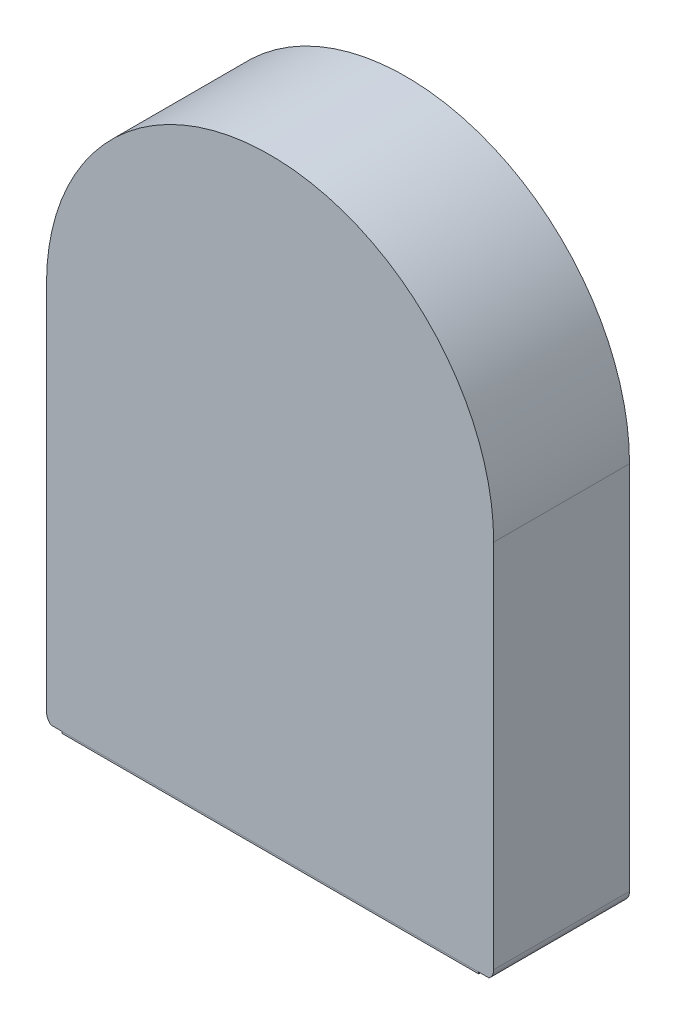
ISO-10303-21;
HEADER;
FILE_DESCRIPTION(('STEP AP214'),'2;1');
FILE_NAME('part.step','',(''),(''),'','','');
FILE_SCHEMA(('AUTOMOTIVE_DESIGN { 1 0 10303 214 1 1 1 1 }'));
ENDSEC;
DATA;
#1=APPLICATION_CONTEXT('core data for automotive mechanical design processes');
#2=APPLICATION_PROTOCOL_DEFINITION('international standard','automotive_design',2000,#1);
#3=PRODUCT_CONTEXT('',#1,'mechanical');
#4=PRODUCT('Part','Part','',(#3));
#5=PRODUCT_RELATED_PRODUCT_CATEGORY('part','',(#4));
#6=PRODUCT_DEFINITION_FORMATION('','',#4);
#7=PRODUCT_DEFINITION_CONTEXT('part definition',#1,'design');
#8=PRODUCT_DEFINITION('design','',#6,#7);
#9=PRODUCT_DEFINITION_SHAPE('','',#8);
#10=(LENGTH_UNIT() NAMED_UNIT(*) SI_UNIT(.MILLI.,.METRE.));
#11=(NAMED_UNIT(*) PLANE_ANGLE_UNIT() SI_UNIT($,.RADIAN.));
#12=(NAMED_UNIT(*) SI_UNIT($,.STERADIAN.) SOLID_ANGLE_UNIT());
#13=UNCERTAINTY_MEASURE_WITH_UNIT(LENGTH_MEASURE(1.E-05),#10,'distance_accuracy_value','');
#14=(GEOMETRIC_REPRESENTATION_CONTEXT(3) GLOBAL_UNCERTAINTY_ASSIGNED_CONTEXT((#13)) GLOBAL_UNIT_ASSIGNED_CONTEXT((#10,
#11,#12)) REPRESENTATION_CONTEXT('',''));
#15=CARTESIAN_POINT('',(0.,0.,0.));
#16=DIRECTION('',(0.,0.,1.));
#17=DIRECTION('',(1.,0.,0.));
#18=AXIS2_PLACEMENT_3D('',#15,#16,#17);
#19=CARTESIAN_POINT('',(8.8,-15.4,5.65));
#20=DIRECTION('',(0.,0.,-1.));
#21=DIRECTION('',(-1.,0.,0.));
#22=AXIS2_PLACEMENT_3D('',#19,#20,#21);
#23=CYLINDRICAL_SURFACE('',#22,0.5);
#24=CARTESIAN_POINT('',(8.8,-15.4,6.03039935251033));
#25=DIRECTION('',(0.,0.713250449154018,-0.700909264300018));
#26=DIRECTION('',(0.,0.700909264300018,0.713250449154018));
#27=AXIS2_PLACEMENT_3D('',#24,#25,#26);
#28=ELLIPSE('',#27,0.713359097199747,0.5);
#29=CARTESIAN_POINT('',(9.10934525730095,-15.7928174026,5.63066545953665));
#30=VERTEX_POINT('',#29);
#31=CARTESIAN_POINT('',(8.8,-15.9,5.52159565602451));
#32=VERTEX_POINT('',#31);
#33=EDGE_CURVE('E55',#30,#32,#28,.T.);
#34=ORIENTED_EDGE('',*,*,#33,.T.);
#35=DIRECTION('',(0.,0.,-1.));
#36=VECTOR('',#35,1.);
#37=CARTESIAN_POINT('',(8.8,-15.9,5.65));
#38=LINE('',#37,#36);
#39=CARTESIAN_POINT('',(8.8,-15.9,0.));
#40=VERTEX_POINT('',#39);
#41=EDGE_CURVE('E257',#40,#32,#38,.F.);
#42=ORIENTED_EDGE('',*,*,#41,.F.);
#43=CARTESIAN_POINT('',(8.8,-15.4,0.));
#44=DIRECTION('',(0.,0.,1.));
#45=DIRECTION('',(1.,0.,0.));
#46=AXIS2_PLACEMENT_3D('',#43,#44,#45);
#47=CIRCLE('',#46,0.5);
#48=CARTESIAN_POINT('',(9.3,-15.4,0.));
#49=VERTEX_POINT('',#48);
#50=EDGE_CURVE('E261',#49,#40,#47,.F.);
#51=ORIENTED_EDGE('',*,*,#50,.F.);
#52=DIRECTION('',(0.,0.,-1.));
#53=VECTOR('',#52,1.);
#54=CARTESIAN_POINT('',(9.3,-15.4,5.65));
#55=LINE('',#54,#53);
#56=CARTESIAN_POINT('',(9.3,-15.4,5.65));
#57=VERTEX_POINT('',#56);
#58=EDGE_CURVE('E265',#57,#49,#55,.T.);
#59=ORIENTED_EDGE('',*,*,#58,.F.);
#60=CARTESIAN_POINT('',(8.8,-15.4,5.65));
#61=DIRECTION('',(0.,0.,1.));
#62=DIRECTION('',(1.,0.,0.));
#63=AXIS2_PLACEMENT_3D('',#60,#61,#62);
#64=CIRCLE('',#63,0.5);
#65=CARTESIAN_POINT('',(9.10934525730095,-15.7928174026,5.65));
#66=VERTEX_POINT('',#65);
#67=EDGE_CURVE('E252',#66,#57,#64,.T.);
#68=ORIENTED_EDGE('',*,*,#67,.F.);
#69=DIRECTION('',(0.,0.,-1.));
#70=VECTOR('',#69,1.);
#71=CARTESIAN_POINT('',(9.10934525730095,-15.7928174026,5.65));
#72=LINE('',#71,#70);
#73=EDGE_CURVE('E48',#30,#66,#72,.F.);
#74=ORIENTED_EDGE('',*,*,#73,.F.);
#75=EDGE_LOOP('',(#34,#42,#51,#59,#68,#74));
#76=FACE_BOUND('',#75,.T.);
#77=ADVANCED_FACE('F38',(#76),#23,.T.);
#78=CARTESIAN_POINT('',(-8.8,-15.4,5.65));
#79=DIRECTION('',(0.,0.,-1.));
#80=DIRECTION('',(-1.,0.,0.));
#81=AXIS2_PLACEMENT_3D('',#78,#79,#80);
#82=CYLINDRICAL_SURFACE('',#81,0.5);
#83=CARTESIAN_POINT('',(-8.8,-15.4,5.65));
#84=DIRECTION('',(0.,0.,1.));
#85=DIRECTION('',(1.,0.,0.));
#86=AXIS2_PLACEMENT_3D('',#83,#84,#85);
#87=CIRCLE('',#86,0.5);
#88=CARTESIAN_POINT('',(-9.3,-15.4,5.65));
#89=VERTEX_POINT('',#88);
#90=CARTESIAN_POINT('',(-9.10934525730095,-15.7928174026,5.65));
#91=VERTEX_POINT('',#90);
#92=EDGE_CURVE('E254',#89,#91,#87,.T.);
#93=ORIENTED_EDGE('',*,*,#92,.F.);
#94=DIRECTION('',(0.,0.,-1.));
#95=VECTOR('',#94,1.);
#96=CARTESIAN_POINT('',(-9.3,-15.4,5.65));
#97=LINE('',#96,#95);
#98=CARTESIAN_POINT('',(-9.3,-15.4,0.));
#99=VERTEX_POINT('',#98);
#100=EDGE_CURVE('E250',#99,#89,#97,.F.);
#101=ORIENTED_EDGE('',*,*,#100,.F.);
#102=CARTESIAN_POINT('',(-8.8,-15.4,0.));
#103=DIRECTION('',(0.,0.,1.));
#104=DIRECTION('',(1.,0.,0.));
#105=AXIS2_PLACEMENT_3D('',#102,#103,#104);
#106=CIRCLE('',#105,0.5);
#107=CARTESIAN_POINT('',(-8.8,-15.9,0.));
#108=VERTEX_POINT('',#107);
#109=EDGE_CURVE('E263',#108,#99,#106,.F.);
#110=ORIENTED_EDGE('',*,*,#109,.F.);
#111=DIRECTION('',(0.,0.,-1.));
#112=VECTOR('',#111,1.);
#113=CARTESIAN_POINT('',(-8.8,-15.9,5.65));
#114=LINE('',#113,#112);
#115=CARTESIAN_POINT('',(-8.8,-15.9,5.52159565602451));
#116=VERTEX_POINT('',#115);
#117=EDGE_CURVE('E259',#116,#108,#114,.T.);
#118=ORIENTED_EDGE('',*,*,#117,.F.);
#119=CARTESIAN_POINT('',(-8.8,-15.4,6.03039935251033));
#120=DIRECTION('',(0.,0.713250449154018,-0.700909264300018));
#121=DIRECTION('',(0.,0.700909264300018,0.713250449154018));
#122=AXIS2_PLACEMENT_3D('',#119,#120,#121);
#123=ELLIPSE('',#122,0.713359097199747,0.5);
#124=CARTESIAN_POINT('',(-9.10934525730095,-15.7928174026,5.63066545953665));
#125=VERTEX_POINT('',#124);
#126=EDGE_CURVE('E145',#116,#125,#123,.T.);
#127=ORIENTED_EDGE('',*,*,#126,.T.);
#128=DIRECTION('',(0.,0.,1.));
#129=VECTOR('',#128,1.);
#130=CARTESIAN_POINT('',(-9.10934525730095,-15.7928174026,5.63066545953665));
#131=LINE('',#130,#129);
#132=EDGE_CURVE('E195',#125,#91,#131,.T.);
#133=ORIENTED_EDGE('',*,*,#132,.T.);
#134=EDGE_LOOP('',(#93,#101,#110,#118,#127,#133));
#135=FACE_BOUND('',#134,.T.);
#136=ADVANCED_FACE('F40',(#135),#82,.T.);
#137=CARTESIAN_POINT('',(0.,0.,5.65));
#138=DIRECTION('',(0.,0.,-1.));
#139=DIRECTION('',(-1.,0.,0.));
#140=AXIS2_PLACEMENT_3D('',#137,#138,#139);
#141=CYLINDRICAL_SURFACE('',#140,9.3);
#142=CARTESIAN_POINT('',(0.,0.,0.));
#143=DIRECTION('',(0.,0.,1.));
#144=DIRECTION('',(1.,0.,0.));
#145=AXIS2_PLACEMENT_3D('',#142,#143,#144);
#146=CIRCLE('',#145,9.3);
#147=CARTESIAN_POINT('',(9.3,0.,0.));
#148=VERTEX_POINT('',#147);
#149=CARTESIAN_POINT('',(-9.3,0.,0.));
#150=VERTEX_POINT('',#149);
#151=EDGE_CURVE('E200',#148,#150,#146,.T.);
#152=ORIENTED_EDGE('',*,*,#151,.T.);
#153=DIRECTION('',(0.,0.,-1.));
#154=VECTOR('',#153,1.);
#155=CARTESIAN_POINT('',(-9.3,0.,5.65));
#156=LINE('',#155,#154);
#157=CARTESIAN_POINT('',(-9.3,0.,5.65));
#158=VERTEX_POINT('',#157);
#159=EDGE_CURVE('E267',#158,#150,#156,.T.);
#160=ORIENTED_EDGE('',*,*,#159,.F.);
#161=CARTESIAN_POINT('',(0.,0.,5.65));
#162=DIRECTION('',(0.,0.,1.));
#163=DIRECTION('',(1.,0.,0.));
#164=AXIS2_PLACEMENT_3D('',#161,#162,#163);
#165=CIRCLE('',#164,9.3);
#166=CARTESIAN_POINT('',(9.3,0.,5.65));
#167=VERTEX_POINT('',#166);
#168=EDGE_CURVE('E244',#167,#158,#165,.T.);
#169=ORIENTED_EDGE('',*,*,#168,.F.);
#170=DIRECTION('',(0.,0.,-1.));
#171=VECTOR('',#170,1.);
#172=CARTESIAN_POINT('',(9.3,0.,5.65));
#173=LINE('',#172,#171);
#174=EDGE_CURVE('E269',#167,#148,#173,.T.);
#175=ORIENTED_EDGE('',*,*,#174,.T.);
#176=EDGE_LOOP('',(#152,#160,#169,#175));
#177=FACE_BOUND('',#176,.T.);
#178=ADVANCED_FACE('F357',(#177),#141,.T.);
#179=CARTESIAN_POINT('',(-9.3,0.,5.65));
#180=DIRECTION('',(1.,0.,0.));
#181=DIRECTION('',(0.,1.,0.));
#182=AXIS2_PLACEMENT_3D('',#179,#180,#181);
#183=PLANE('',#182);
#184=ORIENTED_EDGE('',*,*,#159,.T.);
#185=DIRECTION('',(0.,-1.,0.));
#186=VECTOR('',#185,1.);
#187=CARTESIAN_POINT('',(-9.3,0.,0.));
#188=LINE('',#187,#186);
#189=EDGE_CURVE('E277',#150,#99,#188,.T.);
#190=ORIENTED_EDGE('',*,*,#189,.T.);
#191=ORIENTED_EDGE('',*,*,#100,.T.);
#192=DIRECTION('',(0.,-1.,0.));
#193=VECTOR('',#192,1.);
#194=CARTESIAN_POINT('',(-9.3,0.,5.65));
#195=LINE('',#194,#193);
#196=EDGE_CURVE('E241',#158,#89,#195,.T.);
#197=ORIENTED_EDGE('',*,*,#196,.F.);
#198=EDGE_LOOP('',(#184,#190,#191,#197));
#199=FACE_BOUND('',#198,.T.);
#200=ADVANCED_FACE('F358',(#199),#183,.F.);
#201=CARTESIAN_POINT('',(-9.3,-15.9,5.65));
#202=DIRECTION('',(0.,1.,0.));
#203=DIRECTION('',(0.,0.,1.));
#204=AXIS2_PLACEMENT_3D('',#201,#202,#203);
#205=PLANE('',#204);
#206=ORIENTED_EDGE('',*,*,#41,.T.);
#207=DIRECTION('',(-1.,0.,0.));
#208=VECTOR('',#207,1.);
#209=CARTESIAN_POINT('',(0.,-15.9,5.52159565602451));
#210=LINE('',#209,#208);
#211=EDGE_CURVE('E337',#32,#116,#210,.T.);
#212=ORIENTED_EDGE('',*,*,#211,.T.);
#213=ORIENTED_EDGE('',*,*,#117,.T.);
#214=DIRECTION('',(1.,0.,0.));
#215=VECTOR('',#214,1.);
#216=CARTESIAN_POINT('',(-9.3,-15.9,0.));
#217=LINE('',#216,#215);
#218=EDGE_CURVE('E274',#108,#40,#217,.T.);
#219=ORIENTED_EDGE('',*,*,#218,.T.);
#220=EDGE_LOOP('',(#206,#212,#213,#219));
#221=FACE_BOUND('',#220,.T.);
#222=ADVANCED_FACE('F343',(#221),#205,.F.);
#223=CARTESIAN_POINT('',(9.3,0.,5.65));
#224=DIRECTION('',(-1.,0.,0.));
#225=DIRECTION('',(0.,-1.,0.));
#226=AXIS2_PLACEMENT_3D('',#223,#224,#225);
#227=PLANE('',#226);
#228=ORIENTED_EDGE('',*,*,#58,.T.);
#229=DIRECTION('',(0.,1.,0.));
#230=VECTOR('',#229,1.);
#231=CARTESIAN_POINT('',(9.3,0.,0.));
#232=LINE('',#231,#230);
#233=EDGE_CURVE('E247',#49,#148,#232,.T.);
#234=ORIENTED_EDGE('',*,*,#233,.T.);
#235=ORIENTED_EDGE('',*,*,#174,.F.);
#236=DIRECTION('',(0.,1.,0.));
#237=VECTOR('',#236,1.);
#238=CARTESIAN_POINT('',(9.3,0.,5.65));
#239=LINE('',#238,#237);
#240=EDGE_CURVE('E271',#57,#167,#239,.T.);
#241=ORIENTED_EDGE('',*,*,#240,.F.);
#242=EDGE_LOOP('',(#228,#234,#235,#241));
#243=FACE_BOUND('',#242,.T.);
#244=ADVANCED_FACE('F354',(#243),#227,.F.);
#245=CARTESIAN_POINT('',(0.,0.,5.65));
#246=DIRECTION('',(0.,0.,1.));
#247=DIRECTION('',(1.,0.,0.));
#248=AXIS2_PLACEMENT_3D('',#245,#246,#247);
#249=PLANE('',#248);
#250=DIRECTION('',(1.,0.,0.));
#251=VECTOR('',#250,1.);
#252=CARTESIAN_POINT('',(-5.00000000075,-15.7926514013,5.64999710245));
#253=LINE('',#252,#251);
#254=CARTESIAN_POINT('',(-6.97971042440521,-15.7927344019421,5.64999855122482));
#255=VERTEX_POINT('',#254);
#256=CARTESIAN_POINT('',(2.97381740255382,-15.7926513759911,5.64999855122139));
#257=VERTEX_POINT('',#256);
#258=EDGE_CURVE('E176',#255,#257,#253,.T.);
#259=ORIENTED_EDGE('',*,*,#258,.T.);
#260=DIRECTION('',(0.999999999999744,1.24820653344968E-08,7.15097058320817E-07));
#261=VECTOR('',#260,1.);
#262=CARTESIAN_POINT('',(4.99999999925,-15.792651376,5.64999855136));
#263=LINE('',#262,#261);
#264=CARTESIAN_POINT('',(6.97971041935568,-15.7927343769389,5.64999998352249));
#265=VERTEX_POINT('',#264);
#266=EDGE_CURVE('E179',#257,#265,#263,.T.);
#267=ORIENTED_EDGE('',*,*,#266,.T.);
#268=DIRECTION('',(-1.,0.,0.));
#269=VECTOR('',#268,1.);
#270=CARTESIAN_POINT('',(0.,-15.7928174026,5.65));
#271=LINE('',#270,#269);
#272=EDGE_CURVE('E198',#66,#265,#271,.T.);
#273=ORIENTED_EDGE('',*,*,#272,.F.);
#274=ORIENTED_EDGE('',*,*,#67,.T.);
#275=ORIENTED_EDGE('',*,*,#240,.T.);
#276=ORIENTED_EDGE('',*,*,#168,.T.);
#277=ORIENTED_EDGE('',*,*,#196,.T.);
#278=ORIENTED_EDGE('',*,*,#92,.T.);
#279=DIRECTION('',(-1.,0.,0.));
#280=VECTOR('',#279,1.);
#281=CARTESIAN_POINT('',(0.,-15.7928174026,5.65));
#282=LINE('',#281,#280);
#283=EDGE_CURVE('E11',#255,#91,#282,.T.);
#284=ORIENTED_EDGE('',*,*,#283,.F.);
#285=EDGE_LOOP('',(#259,#267,#273,#274,#275,#276,#277,#278,#284));
#286=FACE_BOUND('',#285,.T.);
#287=ADVANCED_FACE('F287',(#286),#249,.T.);
#288=CARTESIAN_POINT('',(0.,0.,0.));
#289=DIRECTION('',(0.,0.,1.));
#290=DIRECTION('',(1.,0.,0.));
#291=AXIS2_PLACEMENT_3D('',#288,#289,#290);
#292=PLANE('',#291);
#293=ORIENTED_EDGE('',*,*,#233,.F.);
#294=ORIENTED_EDGE('',*,*,#50,.T.);
#295=ORIENTED_EDGE('',*,*,#218,.F.);
#296=ORIENTED_EDGE('',*,*,#109,.T.);
#297=ORIENTED_EDGE('',*,*,#189,.F.);
#298=ORIENTED_EDGE('',*,*,#151,.F.);
#299=EDGE_LOOP('',(#293,#294,#295,#296,#297,#298));
#300=FACE_BOUND('',#299,.T.);
#301=ADVANCED_FACE('F220',(#300),#292,.F.);
#302=CARTESIAN_POINT('',(-10.,-15.7928174026,7.15));
#303=DIRECTION('',(0.,1.,0.));
#304=DIRECTION('',(0.,0.,1.));
#305=AXIS2_PLACEMENT_3D('',#302,#303,#304);
#306=PLANE('',#305);
#307=ORIENTED_EDGE('',*,*,#272,.T.);
#308=CARTESIAN_POINT('',(6.97975192830906,-15.7928174026,5.64048689252252));
#309=DIRECTION('',(-0.00436264473487639,0.0174522403538263,0.999838180225955));
#310=VECTOR('',#309,1.);
#311=LINE('',#308,#310);
#312=CARTESIAN_POINT('',(6.97975192830905,-15.7928174026,5.64048689252252));
#313=VERTEX_POINT('',#312);
#314=EDGE_CURVE('E187',#313,#265,#311,.T.);
#315=ORIENTED_EDGE('',*,*,#314,.F.);
#316=DIRECTION('',(1.,0.,0.));
#317=VECTOR('',#316,1.);
#318=CARTESIAN_POINT('',(-8.66700053469144,-15.7928174026,5.64048689252252));
#319=LINE('',#318,#317);
#320=CARTESIAN_POINT('',(8.66820089689577,-15.7928174026,5.64048689252252));
#321=VERTEX_POINT('',#320);
#322=EDGE_CURVE('E160',#313,#321,#319,.T.);
#323=ORIENTED_EDGE('',*,*,#322,.T.);
#324=DIRECTION('',(0.,0.,-1.));
#325=VECTOR('',#324,1.);
#326=CARTESIAN_POINT('',(8.66820089689577,-15.7928174026,0.999999999999998));
#327=LINE('',#326,#325);
#328=CARTESIAN_POINT('',(8.66821322781513,-15.7928174026,5.63066545953665));
#329=VERTEX_POINT('',#328);
#330=EDGE_CURVE('E152',#321,#329,#327,.T.);
#331=ORIENTED_EDGE('',*,*,#330,.T.);
#332=DIRECTION('',(-1.,0.,0.));
#333=VECTOR('',#332,1.);
#334=CARTESIAN_POINT('',(-4.99999999999999,-15.7928174026002,5.63066545953649));
#335=LINE('',#334,#333);
#336=EDGE_CURVE('E136',#30,#329,#335,.T.);
#337=ORIENTED_EDGE('',*,*,#336,.F.);
#338=ORIENTED_EDGE('',*,*,#73,.T.);
#339=EDGE_LOOP('',(#307,#315,#323,#331,#337,#338));
#340=FACE_BOUND('',#339,.T.);
#341=ADVANCED_FACE('F157',(#340),#306,.F.);
#342=CARTESIAN_POINT('',(8.27396970801,-15.8738174032,0.999999999999998));
#343=DIRECTION('',(0.,-1.,0.));
#344=DIRECTION('',(0.,0.,-1.));
#345=AXIS2_PLACEMENT_3D('',#342,#343,#344);
#346=PLANE('',#345);
#347=DIRECTION('',(1.,0.,0.));
#348=VECTOR('',#347,1.);
#349=CARTESIAN_POINT('',(8.27396970801,-15.8738174032,5.54823926009538));
#350=LINE('',#349,#348);
#351=CARTESIAN_POINT('',(-8.66700053469144,-15.8738174032,5.54823926009538));
#352=VERTEX_POINT('',#351);
#353=CARTESIAN_POINT('',(8.66820089689577,-15.8738174032,5.54823926009538));
#354=VERTEX_POINT('',#353);
#355=EDGE_CURVE('E155',#352,#354,#350,.T.);
#356=ORIENTED_EDGE('',*,*,#355,.T.);
#357=DIRECTION('',(0.,0.,-1.));
#358=VECTOR('',#357,1.);
#359=CARTESIAN_POINT('',(8.66820089689577,-15.8738174032,0.999999999999998));
#360=LINE('',#359,#358);
#361=CARTESIAN_POINT('',(8.66820089689577,-15.8738174032,5.64048689252252));
#362=VERTEX_POINT('',#361);
#363=EDGE_CURVE('E153',#362,#354,#360,.T.);
#364=ORIENTED_EDGE('',*,*,#363,.F.);
#365=DIRECTION('',(1.,0.,0.));
#366=VECTOR('',#365,1.);
#367=CARTESIAN_POINT('',(-8.66700053469144,-15.8738174032,5.64048689252252));
#368=LINE('',#367,#366);
#369=CARTESIAN_POINT('',(-8.66700053469144,-15.8738174032,5.64048689252252));
#370=VERTEX_POINT('',#369);
#371=EDGE_CURVE('E162',#370,#362,#368,.T.);
#372=ORIENTED_EDGE('',*,*,#371,.F.);
#373=DIRECTION('',(0.,0.,1.));
#374=VECTOR('',#373,1.);
#375=CARTESIAN_POINT('',(-8.66700053469144,-15.8738174032,0.999999999999998));
#376=LINE('',#375,#374);
#377=EDGE_CURVE('E321',#352,#370,#376,.T.);
#378=ORIENTED_EDGE('',*,*,#377,.F.);
#379=EDGE_LOOP('',(#356,#364,#372,#378));
#380=FACE_BOUND('',#379,.T.);
#381=ADVANCED_FACE('F219',(#380),#346,.T.);
#382=ORIENTED_EDGE('',*,*,#283,.T.);
#383=ORIENTED_EDGE('',*,*,#132,.F.);
#384=DIRECTION('',(-1.,0.,0.));
#385=VECTOR('',#384,1.);
#386=CARTESIAN_POINT('',(-10.,-15.7928174026,5.63066545953665));
#387=LINE('',#386,#385);
#388=CARTESIAN_POINT('',(-8.66700053469144,-15.7928174026,5.63066545953665));
#389=VERTEX_POINT('',#388);
#390=EDGE_CURVE('E297',#389,#125,#387,.T.);
#391=ORIENTED_EDGE('',*,*,#390,.F.);
#392=DIRECTION('',(0.,0.,1.));
#393=VECTOR('',#392,1.);
#394=CARTESIAN_POINT('',(-8.66700053469144,-15.7928174026,0.999999999999998));
#395=LINE('',#394,#393);
#396=CARTESIAN_POINT('',(-8.66700053469144,-15.7928174026,5.64048689252252));
#397=VERTEX_POINT('',#396);
#398=EDGE_CURVE('E154',#389,#397,#395,.T.);
#399=ORIENTED_EDGE('',*,*,#398,.T.);
#400=CARTESIAN_POINT('',(-6.97975192710905,-15.7928174026,5.64048689252252));
#401=VERTEX_POINT('',#400);
#402=EDGE_CURVE('E163',#397,#401,#319,.T.);
#403=ORIENTED_EDGE('',*,*,#402,.T.);
#404=CARTESIAN_POINT('',(-6.97971043072667,-15.7926514012683,5.64999710244945));
#405=DIRECTION('',(-0.00436264475399805,-0.0174522403537114,-0.999838180225874));
#406=VECTOR('',#405,1.);
#407=LINE('',#404,#406);
#408=EDGE_CURVE('E203',#255,#401,#407,.T.);
#409=ORIENTED_EDGE('',*,*,#408,.F.);
#410=EDGE_LOOP('',(#382,#383,#391,#399,#403,#409));
#411=FACE_BOUND('',#410,.T.);
#412=ADVANCED_FACE('F221',(#411),#306,.F.);
#413=CARTESIAN_POINT('',(8.66820089689577,-33.8193830747908,0.999999999999998));
#414=DIRECTION('',(1.,0.,0.));
#415=DIRECTION('',(0.,0.,-1.));
#416=AXIS2_PLACEMENT_3D('',#413,#414,#415);
#417=PLANE('',#416);
#418=DIRECTION('',(0.,0.700909264300018,0.713250449154018));
#419=VECTOR('',#418,1.);
#420=CARTESIAN_POINT('',(8.66820089689578,-26.9637768566889,-5.73698546753076));
#421=LINE('',#420,#419);
#422=EDGE_CURVE('E140',#354,#329,#421,.T.);
#423=ORIENTED_EDGE('',*,*,#422,.T.);
#424=ORIENTED_EDGE('',*,*,#330,.F.);
#425=DIRECTION('',(0.,1.,0.));
#426=VECTOR('',#425,1.);
#427=CARTESIAN_POINT('',(8.66820089689577,-33.8193830747908,5.64048689252252));
#428=LINE('',#427,#426);
#429=EDGE_CURVE('E166',#362,#321,#428,.T.);
#430=ORIENTED_EDGE('',*,*,#429,.F.);
#431=ORIENTED_EDGE('',*,*,#363,.T.);
#432=EDGE_LOOP('',(#423,#424,#430,#431));
#433=FACE_BOUND('',#432,.T.);
#434=ADVANCED_FACE('F150',(#433),#417,.T.);
#435=CARTESIAN_POINT('',(-8.66700053469144,-33.8193830747908,0.999999999999998));
#436=DIRECTION('',(-1.,0.,0.));
#437=DIRECTION('',(0.,0.,1.));
#438=AXIS2_PLACEMENT_3D('',#435,#436,#437);
#439=PLANE('',#438);
#440=DIRECTION('',(0.,-0.700909264300018,-0.713250449154018));
#441=VECTOR('',#440,1.);
#442=CARTESIAN_POINT('',(-8.66700053469144,-26.9637768566889,-5.73698546753076));
#443=LINE('',#442,#441);
#444=EDGE_CURVE('E146',#389,#352,#443,.T.);
#445=ORIENTED_EDGE('',*,*,#444,.T.);
#446=ORIENTED_EDGE('',*,*,#377,.T.);
#447=DIRECTION('',(0.,1.,0.));
#448=VECTOR('',#447,1.);
#449=CARTESIAN_POINT('',(-8.66700053469144,-33.8193830747908,5.64048689252252));
#450=LINE('',#449,#448);
#451=EDGE_CURVE('E323',#370,#397,#450,.T.);
#452=ORIENTED_EDGE('',*,*,#451,.T.);
#453=ORIENTED_EDGE('',*,*,#398,.F.);
#454=EDGE_LOOP('',(#445,#446,#452,#453));
#455=FACE_BOUND('',#454,.T.);
#456=ADVANCED_FACE('F443',(#455),#439,.T.);
#457=CARTESIAN_POINT('',(9.3,-15.9,-0.500000000000002));
#458=DIRECTION('',(0.,-0.999847695156391,0.0174524064373068));
#459=DIRECTION('',(-1.,0.,0.));
#460=AXIS2_PLACEMENT_3D('',#457,#458,#459);
#461=PLANE('',#460);
#462=ORIENTED_EDGE('',*,*,#314,.T.);
#463=ORIENTED_EDGE('',*,*,#266,.F.);
#464=ORIENTED_EDGE('',*,*,#258,.F.);
#465=ORIENTED_EDGE('',*,*,#408,.T.);
#466=DIRECTION('',(-1.,0.,0.));
#467=VECTOR('',#466,1.);
#468=CARTESIAN_POINT('',(9.3,-15.7928174026,5.64048689252304));
#469=LINE('',#468,#467);
#470=EDGE_CURVE('E180',#313,#401,#469,.T.);
#471=ORIENTED_EDGE('',*,*,#470,.F.);
#472=EDGE_LOOP('',(#462,#463,#464,#465,#471));
#473=FACE_BOUND('',#472,.T.);
#474=ADVANCED_FACE('F224',(#473),#461,.T.);
#475=CARTESIAN_POINT('',(-8.66700053469144,-33.8193830747908,5.64048689252252));
#476=DIRECTION('',(0.,0.,1.));
#477=DIRECTION('',(1.,0.,0.));
#478=AXIS2_PLACEMENT_3D('',#475,#476,#477);
#479=PLANE('',#478);
#480=ORIENTED_EDGE('',*,*,#451,.F.);
#481=ORIENTED_EDGE('',*,*,#371,.T.);
#482=ORIENTED_EDGE('',*,*,#429,.T.);
#483=ORIENTED_EDGE('',*,*,#322,.F.);
#484=ORIENTED_EDGE('',*,*,#470,.T.);
#485=ORIENTED_EDGE('',*,*,#402,.F.);
#486=EDGE_LOOP('',(#480,#481,#482,#483,#484,#485));
#487=FACE_BOUND('',#486,.T.);
#488=ADVANCED_FACE('F222',(#487),#479,.T.);
#489=CARTESIAN_POINT('',(-5.,-15.3316709855,6.09993146282));
#490=DIRECTION('',(0.,0.713250449154018,-0.700909264300018));
#491=DIRECTION('',(-1.,0.,0.));
#492=AXIS2_PLACEMENT_3D('',#489,#490,#491);
#493=PLANE('',#492);
#494=ORIENTED_EDGE('',*,*,#336,.T.);
#495=ORIENTED_EDGE('',*,*,#422,.F.);
#496=ORIENTED_EDGE('',*,*,#355,.F.);
#497=ORIENTED_EDGE('',*,*,#444,.F.);
#498=ORIENTED_EDGE('',*,*,#390,.T.);
#499=ORIENTED_EDGE('',*,*,#126,.F.);
#500=ORIENTED_EDGE('',*,*,#211,.F.);
#501=ORIENTED_EDGE('',*,*,#33,.F.);
#502=EDGE_LOOP('',(#494,#495,#496,#497,#498,#499,#500,#501));
#503=FACE_BOUND('',#502,.T.);
#504=ADVANCED_FACE('F138',(#503),#493,.F.);
#505=CLOSED_SHELL('',(#77,#136,#178,#200,#222,#244,#287,#301,#341,#381,#412,#434,#456,#474,#488,#504));
#506=MANIFOLD_SOLID_BREP('B2',#505);
#507=ADVANCED_BREP_SHAPE_REPRESENTATION('',(#18,#506),#14);
#508=SHAPE_DEFINITION_REPRESENTATION(#9,#507);
ENDSEC;
END-ISO-10303-21;
